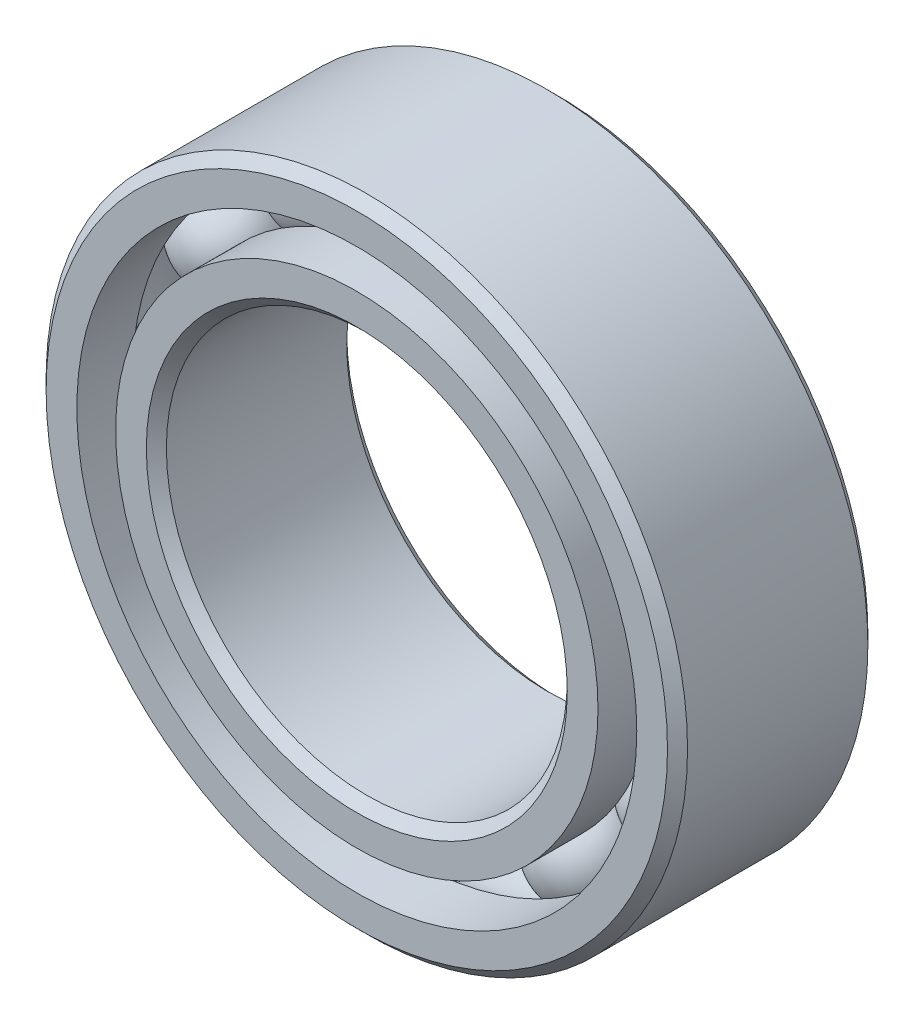
ISO-10303-21;
HEADER;
FILE_DESCRIPTION(('STEP AP214'),'2;1');
FILE_NAME('part.step','',(''),(''),'','','');
FILE_SCHEMA(('AUTOMOTIVE_DESIGN { 1 0 10303 214 1 1 1 1 }'));
ENDSEC;
DATA;
#1=APPLICATION_CONTEXT('core data for automotive mechanical design processes');
#2=APPLICATION_PROTOCOL_DEFINITION('international standard','automotive_design',2000,#1);
#3=PRODUCT_CONTEXT('',#1,'mechanical');
#4=PRODUCT('Part','Part','',(#3));
#5=PRODUCT_RELATED_PRODUCT_CATEGORY('part','',(#4));
#6=PRODUCT_DEFINITION_FORMATION('','',#4);
#7=PRODUCT_DEFINITION_CONTEXT('part definition',#1,'design');
#8=PRODUCT_DEFINITION('design','',#6,#7);
#9=PRODUCT_DEFINITION_SHAPE('','',#8);
#10=(LENGTH_UNIT() NAMED_UNIT(*) SI_UNIT(.MILLI.,.METRE.));
#11=(NAMED_UNIT(*) PLANE_ANGLE_UNIT() SI_UNIT($,.RADIAN.));
#12=(NAMED_UNIT(*) SI_UNIT($,.STERADIAN.) SOLID_ANGLE_UNIT());
#13=UNCERTAINTY_MEASURE_WITH_UNIT(LENGTH_MEASURE(1.E-05),#10,'distance_accuracy_value','');
#14=(GEOMETRIC_REPRESENTATION_CONTEXT(3) GLOBAL_UNCERTAINTY_ASSIGNED_CONTEXT((#13)) GLOBAL_UNIT_ASSIGNED_CONTEXT((#10,
#11,#12)) REPRESENTATION_CONTEXT('',''));
#15=CARTESIAN_POINT('',(0.,0.,0.));
#16=DIRECTION('',(0.,0.,1.));
#17=DIRECTION('',(1.,0.,0.));
#18=AXIS2_PLACEMENT_3D('',#15,#16,#17);
#19=CARTESIAN_POINT('',(-2.57968749999994,4.46814981765037,0.));
#20=DIRECTION('',(0.,0.,1.));
#21=DIRECTION('',(-0.499999999999989,0.866025403784445,0.));
#22=AXIS2_PLACEMENT_3D('',#19,#20,#21);
#23=SPHERICAL_SURFACE('',#22,0.961595974831125);
#24=CARTESIAN_POINT('',(-2.57968749999994,4.46814981765037,0.961595974831125));
#25=VERTEX_POINT('',#24);
#26=VERTEX_LOOP('',#25);
#27=FACE_BOUND('',#26,.T.);
#28=ADVANCED_FACE('F43',(#27),#23,.T.);
#29=CLOSED_SHELL('',(#28));
#30=MANIFOLD_SOLID_BREP('B2',#29);
#31=CARTESIAN_POINT('',(-4.46814981765031,2.57968750000005,0.));
#32=DIRECTION('',(0.,0.,1.));
#33=DIRECTION('',(-0.866025403784433,0.50000000000001,0.));
#34=AXIS2_PLACEMENT_3D('',#31,#32,#33);
#35=SPHERICAL_SURFACE('',#34,0.961595974831125);
#36=CARTESIAN_POINT('',(-4.46814981765031,2.57968750000005,0.961595974831125));
#37=VERTEX_POINT('',#36);
#38=VERTEX_LOOP('',#37);
#39=FACE_BOUND('',#38,.T.);
#40=ADVANCED_FACE('F63',(#39),#35,.T.);
#41=CLOSED_SHELL('',(#40));
#42=MANIFOLD_SOLID_BREP('B6',#41);
#43=CARTESIAN_POINT('',(-5.159375,0.,0.));
#44=DIRECTION('',(0.,0.,1.));
#45=DIRECTION('',(-1.,0.,0.));
#46=AXIS2_PLACEMENT_3D('',#43,#44,#45);
#47=SPHERICAL_SURFACE('',#46,0.961595974831125);
#48=CARTESIAN_POINT('',(-5.159375,0.,0.961595974831125));
#49=VERTEX_POINT('',#48);
#50=VERTEX_LOOP('',#49);
#51=FACE_BOUND('',#50,.T.);
#52=ADVANCED_FACE('F83',(#51),#47,.T.);
#53=CLOSED_SHELL('',(#52));
#54=MANIFOLD_SOLID_BREP('B39',#53);
#55=CARTESIAN_POINT('',(-4.46814981765036,-2.57968749999996,0.));
#56=DIRECTION('',(0.,0.,1.));
#57=DIRECTION('',(-0.866025403784443,-0.499999999999992,0.));
#58=AXIS2_PLACEMENT_3D('',#55,#56,#57);
#59=SPHERICAL_SURFACE('',#58,0.961595974831125);
#60=CARTESIAN_POINT('',(-4.46814981765036,-2.57968749999996,0.961595974831125));
#61=VERTEX_POINT('',#60);
#62=VERTEX_LOOP('',#61);
#63=FACE_BOUND('',#62,.T.);
#64=ADVANCED_FACE('F103',(#63),#59,.T.);
#65=CLOSED_SHELL('',(#64));
#66=MANIFOLD_SOLID_BREP('B59',#65);
#67=CARTESIAN_POINT('',(-2.57968750000004,-4.46814981765032,0.));
#68=DIRECTION('',(0.,0.,1.));
#69=DIRECTION('',(-0.500000000000007,-0.866025403784435,0.));
#70=AXIS2_PLACEMENT_3D('',#67,#68,#69);
#71=SPHERICAL_SURFACE('',#70,0.961595974831125);
#72=CARTESIAN_POINT('',(-2.57968750000004,-4.46814981765032,0.961595974831125));
#73=VERTEX_POINT('',#72);
#74=VERTEX_LOOP('',#73);
#75=FACE_BOUND('',#74,.T.);
#76=ADVANCED_FACE('F123',(#75),#71,.T.);
#77=CLOSED_SHELL('',(#76));
#78=MANIFOLD_SOLID_BREP('B79',#77);
#79=CARTESIAN_POINT('',(0.,-5.159375,0.));
#80=DIRECTION('',(0.,0.,1.));
#81=DIRECTION('',(0.,-1.,0.));
#82=AXIS2_PLACEMENT_3D('',#79,#80,#81);
#83=SPHERICAL_SURFACE('',#82,0.961595974831125);
#84=CARTESIAN_POINT('',(0.,-5.159375,0.961595974831125));
#85=VERTEX_POINT('',#84);
#86=VERTEX_LOOP('',#85);
#87=FACE_BOUND('',#86,.T.);
#88=ADVANCED_FACE('F143',(#87),#83,.T.);
#89=CLOSED_SHELL('',(#88));
#90=MANIFOLD_SOLID_BREP('B99',#89);
#91=CARTESIAN_POINT('',(2.57968749999997,-4.46814981765035,0.));
#92=DIRECTION('',(0.,0.,1.));
#93=DIRECTION('',(0.499999999999995,-0.866025403784442,0.));
#94=AXIS2_PLACEMENT_3D('',#91,#92,#93);
#95=SPHERICAL_SURFACE('',#94,0.961595974831125);
#96=CARTESIAN_POINT('',(2.57968749999997,-4.46814981765035,0.961595974831125));
#97=VERTEX_POINT('',#96);
#98=VERTEX_LOOP('',#97);
#99=FACE_BOUND('',#98,.T.);
#100=ADVANCED_FACE('F163',(#99),#95,.T.);
#101=CLOSED_SHELL('',(#100));
#102=MANIFOLD_SOLID_BREP('B119',#101);
#103=CARTESIAN_POINT('',(4.46814981765033,-2.57968750000002,0.));
#104=DIRECTION('',(0.,0.,1.));
#105=DIRECTION('',(0.866025403784436,-0.500000000000004,0.));
#106=AXIS2_PLACEMENT_3D('',#103,#104,#105);
#107=SPHERICAL_SURFACE('',#106,0.961595974831125);
#108=CARTESIAN_POINT('',(4.46814981765033,-2.57968750000002,0.961595974831125));
#109=VERTEX_POINT('',#108);
#110=VERTEX_LOOP('',#109);
#111=FACE_BOUND('',#110,.T.);
#112=ADVANCED_FACE('F183',(#111),#107,.T.);
#113=CLOSED_SHELL('',(#112));
#114=MANIFOLD_SOLID_BREP('B139',#113);
#115=CARTESIAN_POINT('',(5.159375,0.,0.));
#116=DIRECTION('',(0.,0.,1.));
#117=DIRECTION('',(1.,0.,0.));
#118=AXIS2_PLACEMENT_3D('',#115,#116,#117);
#119=SPHERICAL_SURFACE('',#118,0.961595974831125);
#120=CARTESIAN_POINT('',(5.159375,0.,0.961595974831125));
#121=VERTEX_POINT('',#120);
#122=VERTEX_LOOP('',#121);
#123=FACE_BOUND('',#122,.T.);
#124=ADVANCED_FACE('F203',(#123),#119,.T.);
#125=CLOSED_SHELL('',(#124));
#126=MANIFOLD_SOLID_BREP('B159',#125);
#127=CARTESIAN_POINT('',(4.46814981765034,2.57968749999999,0.));
#128=DIRECTION('',(0.,0.,1.));
#129=DIRECTION('',(0.86602540378444,0.499999999999998,0.));
#130=AXIS2_PLACEMENT_3D('',#127,#128,#129);
#131=SPHERICAL_SURFACE('',#130,0.961595974831125);
#132=CARTESIAN_POINT('',(4.46814981765034,2.57968749999999,0.961595974831125));
#133=VERTEX_POINT('',#132);
#134=VERTEX_LOOP('',#133);
#135=FACE_BOUND('',#134,.T.);
#136=ADVANCED_FACE('F223',(#135),#131,.T.);
#137=CLOSED_SHELL('',(#136));
#138=MANIFOLD_SOLID_BREP('B179',#137);
#139=CARTESIAN_POINT('',(2.57968750000001,4.46814981765033,0.));
#140=DIRECTION('',(0.,0.,1.));
#141=DIRECTION('',(0.500000000000001,0.866025403784438,0.));
#142=AXIS2_PLACEMENT_3D('',#139,#140,#141);
#143=SPHERICAL_SURFACE('',#142,0.961595974831125);
#144=CARTESIAN_POINT('',(2.57968750000001,4.46814981765033,0.961595974831125));
#145=VERTEX_POINT('',#144);
#146=VERTEX_LOOP('',#145);
#147=FACE_BOUND('',#146,.T.);
#148=ADVANCED_FACE('F243',(#147),#143,.T.);
#149=CLOSED_SHELL('',(#148));
#150=MANIFOLD_SOLID_BREP('B199',#149);
#151=CARTESIAN_POINT('',(0.,5.159375,0.));
#152=DIRECTION('',(0.,0.,1.));
#153=DIRECTION('',(0.,1.,0.));
#154=AXIS2_PLACEMENT_3D('',#151,#152,#153);
#155=SPHERICAL_SURFACE('',#154,0.961595974831125);
#156=CARTESIAN_POINT('',(0.,5.159375,0.961595974831125));
#157=VERTEX_POINT('',#156);
#158=VERTEX_LOOP('',#157);
#159=FACE_BOUND('',#158,.T.);
#160=ADVANCED_FACE('F265',(#159),#155,.T.);
#161=CLOSED_SHELL('',(#160));
#162=MANIFOLD_SOLID_BREP('B219',#161);
#163=CARTESIAN_POINT('',(0.,4.77552796703297,1.98374));
#164=DIRECTION('',(0.,0.,-1.));
#165=DIRECTION('',(-1.,0.,0.));
#166=AXIS2_PLACEMENT_3D('',#163,#164,#165);
#167=PLANE('',#166);
#168=CARTESIAN_POINT('',(0.,0.,1.98374));
#169=DIRECTION('',(0.,0.,1.));
#170=DIRECTION('',(1.,0.,0.));
#171=AXIS2_PLACEMENT_3D('',#168,#169,#170);
#172=CIRCLE('',#171,4.167124);
#173=CARTESIAN_POINT('',(4.167124,0.,1.98374));
#174=VERTEX_POINT('',#173);
#175=EDGE_CURVE('E312',#174,#174,#172,.T.);
#176=ORIENTED_EDGE('',*,*,#175,.F.);
#177=EDGE_LOOP('',(#176));
#178=FACE_BOUND('',#177,.T.);
#179=CARTESIAN_POINT('',(0.,0.,1.98374));
#180=DIRECTION('',(0.,0.,1.));
#181=DIRECTION('',(1.,0.,0.));
#182=AXIS2_PLACEMENT_3D('',#179,#180,#181);
#183=CIRCLE('',#182,4.77552796703297);
#184=CARTESIAN_POINT('',(4.77552796703297,0.,1.98374));
#185=VERTEX_POINT('',#184);
#186=EDGE_CURVE('E264',#185,#185,#183,.T.);
#187=ORIENTED_EDGE('',*,*,#186,.T.);
#188=EDGE_LOOP('',(#187));
#189=FACE_BOUND('',#188,.T.);
#190=ADVANCED_FACE('F284',(#178,#189),#167,.F.);
#191=CARTESIAN_POINT('',(0.,0.,1.98374));
#192=DIRECTION('',(0.,0.,1.));
#193=DIRECTION('',(1.,0.,0.));
#194=AXIS2_PLACEMENT_3D('',#191,#192,#193);
#195=CYLINDRICAL_SURFACE('',#194,4.77552796703297);
#196=ORIENTED_EDGE('',*,*,#186,.F.);
#197=EDGE_LOOP('',(#196));
#198=FACE_BOUND('',#197,.T.);
#199=CARTESIAN_POINT('',(0.,0.,0.881662222222222));
#200=DIRECTION('',(0.,0.,1.));
#201=DIRECTION('',(1.,0.,0.));
#202=AXIS2_PLACEMENT_3D('',#199,#200,#201);
#203=CIRCLE('',#202,4.77552796703297);
#204=CARTESIAN_POINT('',(4.77552796703297,0.,0.881662222222222));
#205=VERTEX_POINT('',#204);
#206=EDGE_CURVE('E290',#205,#205,#203,.T.);
#207=ORIENTED_EDGE('',*,*,#206,.T.);
#208=EDGE_LOOP('',(#207));
#209=FACE_BOUND('',#208,.T.);
#210=ADVANCED_FACE('F319',(#198,#209),#195,.T.);
#211=CARTESIAN_POINT('',(0.,0.,0.));
#212=DIRECTION('',(0.,0.,1.));
#213=DIRECTION('',(1.,0.,0.));
#214=AXIS2_PLACEMENT_3D('',#211,#212,#213);
#215=TOROIDAL_SURFACE('',#214,5.159375,0.961595974831123);
#216=ORIENTED_EDGE('',*,*,#206,.F.);
#217=EDGE_LOOP('',(#216));
#218=FACE_BOUND('',#217,.T.);
#219=CARTESIAN_POINT('',(0.,0.,-0.881662222222223));
#220=DIRECTION('',(0.,0.,1.));
#221=DIRECTION('',(1.,0.,0.));
#222=AXIS2_PLACEMENT_3D('',#219,#220,#221);
#223=CIRCLE('',#222,4.77552796703297);
#224=CARTESIAN_POINT('',(4.77552796703297,0.,-0.881662222222223));
#225=VERTEX_POINT('',#224);
#226=EDGE_CURVE('E294',#225,#225,#223,.T.);
#227=ORIENTED_EDGE('',*,*,#226,.T.);
#228=EDGE_LOOP('',(#227));
#229=FACE_BOUND('',#228,.T.);
#230=ADVANCED_FACE('F323',(#218,#229),#215,.F.);
#231=CARTESIAN_POINT('',(0.,0.,1.98374));
#232=DIRECTION('',(0.,0.,1.));
#233=DIRECTION('',(1.,0.,0.));
#234=AXIS2_PLACEMENT_3D('',#231,#232,#233);
#235=CYLINDRICAL_SURFACE('',#234,4.77552796703297);
#236=ORIENTED_EDGE('',*,*,#226,.F.);
#237=EDGE_LOOP('',(#236));
#238=FACE_BOUND('',#237,.T.);
#239=CARTESIAN_POINT('',(0.,0.,-1.98374));
#240=DIRECTION('',(0.,0.,1.));
#241=DIRECTION('',(1.,0.,0.));
#242=AXIS2_PLACEMENT_3D('',#239,#240,#241);
#243=CIRCLE('',#242,4.77552796703297);
#244=CARTESIAN_POINT('',(4.77552796703297,0.,-1.98374));
#245=VERTEX_POINT('',#244);
#246=EDGE_CURVE('E298',#245,#245,#243,.T.);
#247=ORIENTED_EDGE('',*,*,#246,.T.);
#248=EDGE_LOOP('',(#247));
#249=FACE_BOUND('',#248,.T.);
#250=ADVANCED_FACE('F328',(#238,#249),#235,.T.);
#251=CARTESIAN_POINT('',(0.,4.167124,-1.98374));
#252=DIRECTION('',(0.,0.,1.));
#253=DIRECTION('',(1.,0.,0.));
#254=AXIS2_PLACEMENT_3D('',#251,#252,#253);
#255=PLANE('',#254);
#256=ORIENTED_EDGE('',*,*,#246,.F.);
#257=EDGE_LOOP('',(#256));
#258=FACE_BOUND('',#257,.T.);
#259=CARTESIAN_POINT('',(0.,0.,-1.98374));
#260=DIRECTION('',(0.,0.,1.));
#261=DIRECTION('',(1.,0.,0.));
#262=AXIS2_PLACEMENT_3D('',#259,#260,#261);
#263=CIRCLE('',#262,4.167124);
#264=CARTESIAN_POINT('',(4.167124,0.,-1.98374));
#265=VERTEX_POINT('',#264);
#266=EDGE_CURVE('E303',#265,#265,#263,.T.);
#267=ORIENTED_EDGE('',*,*,#266,.T.);
#268=EDGE_LOOP('',(#267));
#269=FACE_BOUND('',#268,.T.);
#270=ADVANCED_FACE('F334',(#258,#269),#255,.F.);
#271=CARTESIAN_POINT('',(0.,0.,-1.785366));
#272=DIRECTION('',(0.,0.,-1.));
#273=DIRECTION('',(-1.,0.,0.));
#274=AXIS2_PLACEMENT_3D('',#271,#272,#273);
#275=CONICAL_SURFACE('',#274,3.96875,0.785398163397447);
#276=ORIENTED_EDGE('',*,*,#266,.F.);
#277=EDGE_LOOP('',(#276));
#278=FACE_BOUND('',#277,.T.);
#279=CARTESIAN_POINT('',(0.,0.,-1.785366));
#280=DIRECTION('',(0.,0.,1.));
#281=DIRECTION('',(1.,0.,0.));
#282=AXIS2_PLACEMENT_3D('',#279,#280,#281);
#283=CIRCLE('',#282,3.96875);
#284=CARTESIAN_POINT('',(3.96875,0.,-1.785366));
#285=VERTEX_POINT('',#284);
#286=EDGE_CURVE('E306',#285,#285,#283,.T.);
#287=ORIENTED_EDGE('',*,*,#286,.T.);
#288=EDGE_LOOP('',(#287));
#289=FACE_BOUND('',#288,.T.);
#290=ADVANCED_FACE('F338',(#278,#289),#275,.F.);
#291=CARTESIAN_POINT('',(0.,0.,1.98374));
#292=DIRECTION('',(0.,0.,1.));
#293=DIRECTION('',(1.,0.,0.));
#294=AXIS2_PLACEMENT_3D('',#291,#292,#293);
#295=CYLINDRICAL_SURFACE('',#294,3.96875);
#296=ORIENTED_EDGE('',*,*,#286,.F.);
#297=EDGE_LOOP('',(#296));
#298=FACE_BOUND('',#297,.T.);
#299=CARTESIAN_POINT('',(0.,0.,1.785366));
#300=DIRECTION('',(0.,0.,1.));
#301=DIRECTION('',(1.,0.,0.));
#302=AXIS2_PLACEMENT_3D('',#299,#300,#301);
#303=CIRCLE('',#302,3.96875);
#304=CARTESIAN_POINT('',(3.96875,0.,1.785366));
#305=VERTEX_POINT('',#304);
#306=EDGE_CURVE('E309',#305,#305,#303,.T.);
#307=ORIENTED_EDGE('',*,*,#306,.T.);
#308=EDGE_LOOP('',(#307));
#309=FACE_BOUND('',#308,.T.);
#310=ADVANCED_FACE('F342',(#298,#309),#295,.F.);
#311=CARTESIAN_POINT('',(0.,0.,1.98374));
#312=DIRECTION('',(0.,0.,1.));
#313=DIRECTION('',(1.,0.,0.));
#314=AXIS2_PLACEMENT_3D('',#311,#312,#313);
#315=CONICAL_SURFACE('',#314,4.167124,0.785398163397448);
#316=ORIENTED_EDGE('',*,*,#306,.F.);
#317=EDGE_LOOP('',(#316));
#318=FACE_BOUND('',#317,.T.);
#319=ORIENTED_EDGE('',*,*,#175,.T.);
#320=EDGE_LOOP('',(#319));
#321=FACE_BOUND('',#320,.T.);
#322=ADVANCED_FACE('F316',(#318,#321),#315,.F.);
#323=CLOSED_SHELL('',(#190,#210,#230,#250,#270,#290,#310,#322));
#324=MANIFOLD_SOLID_BREP('B239',#323);
#325=CARTESIAN_POINT('',(0.,0.,1.785366));
#326=DIRECTION('',(0.,0.,-1.));
#327=DIRECTION('',(-1.,0.,0.));
#328=AXIS2_PLACEMENT_3D('',#325,#326,#327);
#329=CONICAL_SURFACE('',#328,6.35,0.785398163397447);
#330=CARTESIAN_POINT('',(0.,0.,1.98374));
#331=DIRECTION('',(0.,0.,1.));
#332=DIRECTION('',(1.,0.,0.));
#333=AXIS2_PLACEMENT_3D('',#330,#331,#332);
#334=CIRCLE('',#333,6.151626);
#335=CARTESIAN_POINT('',(6.151626,0.,1.98374));
#336=VERTEX_POINT('',#335);
#337=EDGE_CURVE('E433',#336,#336,#334,.T.);
#338=ORIENTED_EDGE('',*,*,#337,.F.);
#339=EDGE_LOOP('',(#338));
#340=FACE_BOUND('',#339,.T.);
#341=CARTESIAN_POINT('',(0.,0.,1.785366));
#342=DIRECTION('',(0.,0.,1.));
#343=DIRECTION('',(1.,0.,0.));
#344=AXIS2_PLACEMENT_3D('',#341,#342,#343);
#345=CIRCLE('',#344,6.35);
#346=CARTESIAN_POINT('',(6.35,0.,1.785366));
#347=VERTEX_POINT('',#346);
#348=EDGE_CURVE('E283',#347,#347,#345,.T.);
#349=ORIENTED_EDGE('',*,*,#348,.T.);
#350=EDGE_LOOP('',(#349));
#351=FACE_BOUND('',#350,.T.);
#352=ADVANCED_FACE('F405',(#340,#351),#329,.T.);
#353=CARTESIAN_POINT('',(0.,0.,1.98374));
#354=DIRECTION('',(0.,0.,1.));
#355=DIRECTION('',(1.,0.,0.));
#356=AXIS2_PLACEMENT_3D('',#353,#354,#355);
#357=CYLINDRICAL_SURFACE('',#356,6.35);
#358=ORIENTED_EDGE('',*,*,#348,.F.);
#359=EDGE_LOOP('',(#358));
#360=FACE_BOUND('',#359,.T.);
#361=CARTESIAN_POINT('',(0.,0.,-1.785366));
#362=DIRECTION('',(0.,0.,1.));
#363=DIRECTION('',(1.,0.,0.));
#364=AXIS2_PLACEMENT_3D('',#361,#362,#363);
#365=CIRCLE('',#364,6.35);
#366=CARTESIAN_POINT('',(6.35,0.,-1.785366));
#367=VERTEX_POINT('',#366);
#368=EDGE_CURVE('E411',#367,#367,#365,.T.);
#369=ORIENTED_EDGE('',*,*,#368,.T.);
#370=EDGE_LOOP('',(#369));
#371=FACE_BOUND('',#370,.T.);
#372=ADVANCED_FACE('F440',(#360,#371),#357,.T.);
#373=CARTESIAN_POINT('',(0.,0.,-1.98374));
#374=DIRECTION('',(0.,0.,1.));
#375=DIRECTION('',(1.,0.,0.));
#376=AXIS2_PLACEMENT_3D('',#373,#374,#375);
#377=CONICAL_SURFACE('',#376,6.151626,0.785398163397447);
#378=ORIENTED_EDGE('',*,*,#368,.F.);
#379=EDGE_LOOP('',(#378));
#380=FACE_BOUND('',#379,.T.);
#381=CARTESIAN_POINT('',(0.,0.,-1.98374));
#382=DIRECTION('',(0.,0.,1.));
#383=DIRECTION('',(1.,0.,0.));
#384=AXIS2_PLACEMENT_3D('',#381,#382,#383);
#385=CIRCLE('',#384,6.151626);
#386=CARTESIAN_POINT('',(6.151626,0.,-1.98374));
#387=VERTEX_POINT('',#386);
#388=EDGE_CURVE('E415',#387,#387,#385,.T.);
#389=ORIENTED_EDGE('',*,*,#388,.T.);
#390=EDGE_LOOP('',(#389));
#391=FACE_BOUND('',#390,.T.);
#392=ADVANCED_FACE('F444',(#380,#391),#377,.T.);
#393=CARTESIAN_POINT('',(0.,6.151626,-1.98374));
#394=DIRECTION('',(0.,0.,1.));
#395=DIRECTION('',(1.,0.,0.));
#396=AXIS2_PLACEMENT_3D('',#393,#394,#395);
#397=PLANE('',#396);
#398=ORIENTED_EDGE('',*,*,#388,.F.);
#399=EDGE_LOOP('',(#398));
#400=FACE_BOUND('',#399,.T.);
#401=CARTESIAN_POINT('',(0.,0.,-1.98374));
#402=DIRECTION('',(0.,0.,1.));
#403=DIRECTION('',(1.,0.,0.));
#404=AXIS2_PLACEMENT_3D('',#401,#402,#403);
#405=CIRCLE('',#404,5.54322203296703);
#406=CARTESIAN_POINT('',(5.54322203296703,0.,-1.98374));
#407=VERTEX_POINT('',#406);
#408=EDGE_CURVE('E419',#407,#407,#405,.T.);
#409=ORIENTED_EDGE('',*,*,#408,.T.);
#410=EDGE_LOOP('',(#409));
#411=FACE_BOUND('',#410,.T.);
#412=ADVANCED_FACE('F449',(#400,#411),#397,.F.);
#413=CARTESIAN_POINT('',(0.,0.,1.98374));
#414=DIRECTION('',(0.,0.,1.));
#415=DIRECTION('',(1.,0.,0.));
#416=AXIS2_PLACEMENT_3D('',#413,#414,#415);
#417=CYLINDRICAL_SURFACE('',#416,5.54322203296703);
#418=ORIENTED_EDGE('',*,*,#408,.F.);
#419=EDGE_LOOP('',(#418));
#420=FACE_BOUND('',#419,.T.);
#421=CARTESIAN_POINT('',(0.,0.,-0.881662222222222));
#422=DIRECTION('',(0.,0.,1.));
#423=DIRECTION('',(1.,0.,0.));
#424=AXIS2_PLACEMENT_3D('',#421,#422,#423);
#425=CIRCLE('',#424,5.54322203296703);
#426=CARTESIAN_POINT('',(5.54322203296703,0.,-0.881662222222222));
#427=VERTEX_POINT('',#426);
#428=EDGE_CURVE('E424',#427,#427,#425,.T.);
#429=ORIENTED_EDGE('',*,*,#428,.T.);
#430=EDGE_LOOP('',(#429));
#431=FACE_BOUND('',#430,.T.);
#432=ADVANCED_FACE('F455',(#420,#431),#417,.F.);
#433=CARTESIAN_POINT('',(0.,0.,0.));
#434=DIRECTION('',(0.,0.,1.));
#435=DIRECTION('',(1.,0.,0.));
#436=AXIS2_PLACEMENT_3D('',#433,#434,#435);
#437=TOROIDAL_SURFACE('',#436,5.159375,0.961595974831125);
#438=ORIENTED_EDGE('',*,*,#428,.F.);
#439=EDGE_LOOP('',(#438));
#440=FACE_BOUND('',#439,.T.);
#441=CARTESIAN_POINT('',(0.,0.,0.881662222222222));
#442=DIRECTION('',(0.,0.,1.));
#443=DIRECTION('',(1.,0.,0.));
#444=AXIS2_PLACEMENT_3D('',#441,#442,#443);
#445=CIRCLE('',#444,5.54322203296703);
#446=CARTESIAN_POINT('',(5.54322203296703,0.,0.881662222222222));
#447=VERTEX_POINT('',#446);
#448=EDGE_CURVE('E427',#447,#447,#445,.T.);
#449=ORIENTED_EDGE('',*,*,#448,.T.);
#450=EDGE_LOOP('',(#449));
#451=FACE_BOUND('',#450,.T.);
#452=ADVANCED_FACE('F459',(#440,#451),#437,.F.);
#453=CARTESIAN_POINT('',(0.,0.,1.98374));
#454=DIRECTION('',(0.,0.,1.));
#455=DIRECTION('',(1.,0.,0.));
#456=AXIS2_PLACEMENT_3D('',#453,#454,#455);
#457=CYLINDRICAL_SURFACE('',#456,5.54322203296703);
#458=ORIENTED_EDGE('',*,*,#448,.F.);
#459=EDGE_LOOP('',(#458));
#460=FACE_BOUND('',#459,.T.);
#461=CARTESIAN_POINT('',(0.,0.,1.98374));
#462=DIRECTION('',(0.,0.,1.));
#463=DIRECTION('',(1.,0.,0.));
#464=AXIS2_PLACEMENT_3D('',#461,#462,#463);
#465=CIRCLE('',#464,5.54322203296703);
#466=CARTESIAN_POINT('',(5.54322203296703,0.,1.98374));
#467=VERTEX_POINT('',#466);
#468=EDGE_CURVE('E430',#467,#467,#465,.T.);
#469=ORIENTED_EDGE('',*,*,#468,.T.);
#470=EDGE_LOOP('',(#469));
#471=FACE_BOUND('',#470,.T.);
#472=ADVANCED_FACE('F463',(#460,#471),#457,.F.);
#473=CARTESIAN_POINT('',(0.,6.151626,1.98374));
#474=DIRECTION('',(0.,0.,-1.));
#475=DIRECTION('',(-1.,0.,0.));
#476=AXIS2_PLACEMENT_3D('',#473,#474,#475);
#477=PLANE('',#476);
#478=ORIENTED_EDGE('',*,*,#468,.F.);
#479=EDGE_LOOP('',(#478));
#480=FACE_BOUND('',#479,.T.);
#481=ORIENTED_EDGE('',*,*,#337,.T.);
#482=EDGE_LOOP('',(#481));
#483=FACE_BOUND('',#482,.T.);
#484=ADVANCED_FACE('F437',(#480,#483),#477,.F.);
#485=CLOSED_SHELL('',(#352,#372,#392,#412,#432,#452,#472,#484));
#486=MANIFOLD_SOLID_BREP('B259',#485);
#487=ADVANCED_BREP_SHAPE_REPRESENTATION('',(#18,#30,#42,#54,#66,#78,#90,#102,#114,#126,#138,
#150,#162,#324,#486),#14);
#488=SHAPE_DEFINITION_REPRESENTATION(#9,#487);
ENDSEC;
END-ISO-10303-21;
